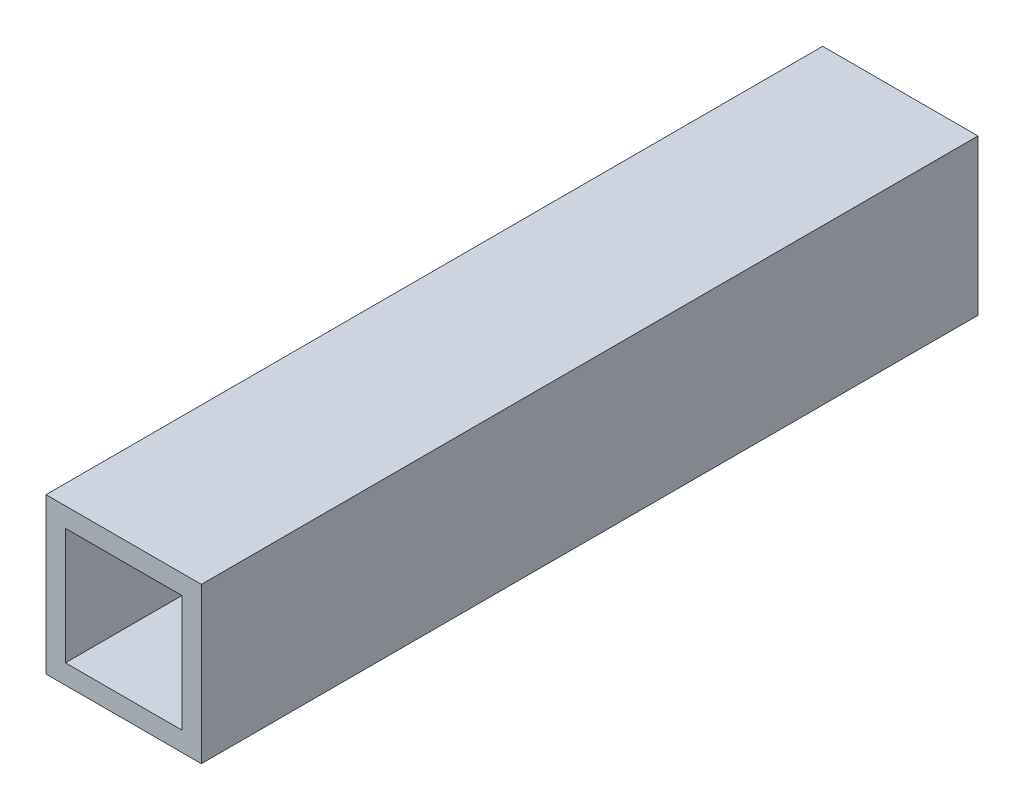
ISO-10303-21;
HEADER;
FILE_DESCRIPTION(('STEP AP214'),'2;1');
FILE_NAME('part.step','',(''),(''),'','','');
FILE_SCHEMA(('AUTOMOTIVE_DESIGN { 1 0 10303 214 1 1 1 1 }'));
ENDSEC;
DATA;
#1=APPLICATION_CONTEXT('core data for automotive mechanical design processes');
#2=APPLICATION_PROTOCOL_DEFINITION('international standard','automotive_design',2000,#1);
#3=PRODUCT_CONTEXT('',#1,'mechanical');
#4=PRODUCT('Part','Part','',(#3));
#5=PRODUCT_RELATED_PRODUCT_CATEGORY('part','',(#4));
#6=PRODUCT_DEFINITION_FORMATION('','',#4);
#7=PRODUCT_DEFINITION_CONTEXT('part definition',#1,'design');
#8=PRODUCT_DEFINITION('design','',#6,#7);
#9=PRODUCT_DEFINITION_SHAPE('','',#8);
#10=(LENGTH_UNIT() NAMED_UNIT(*) SI_UNIT(.MILLI.,.METRE.));
#11=(NAMED_UNIT(*) PLANE_ANGLE_UNIT() SI_UNIT($,.RADIAN.));
#12=(NAMED_UNIT(*) SI_UNIT($,.STERADIAN.) SOLID_ANGLE_UNIT());
#13=UNCERTAINTY_MEASURE_WITH_UNIT(LENGTH_MEASURE(1.E-05),#10,'distance_accuracy_value','');
#14=(GEOMETRIC_REPRESENTATION_CONTEXT(3) GLOBAL_UNCERTAINTY_ASSIGNED_CONTEXT((#13)) GLOBAL_UNIT_ASSIGNED_CONTEXT((#10,
#11,#12)) REPRESENTATION_CONTEXT('',''));
#15=CARTESIAN_POINT('',(0.,0.,0.));
#16=DIRECTION('',(0.,0.,1.));
#17=DIRECTION('',(1.,0.,0.));
#18=AXIS2_PLACEMENT_3D('',#15,#16,#17);
#19=CARTESIAN_POINT('',(0.,0.,127.));
#20=DIRECTION('',(0.,0.,1.));
#21=DIRECTION('',(1.,0.,0.));
#22=AXIS2_PLACEMENT_3D('',#19,#20,#21);
#23=PLANE('',#22);
#24=DIRECTION('',(0.,-1.,0.));
#25=VECTOR('',#24,1.);
#26=CARTESIAN_POINT('',(-12.7,-12.7,127.));
#27=LINE('',#26,#25);
#28=CARTESIAN_POINT('',(-12.7,12.7,127.));
#29=VERTEX_POINT('',#28);
#30=CARTESIAN_POINT('',(-12.7,-12.7,127.));
#31=VERTEX_POINT('',#30);
#32=EDGE_CURVE('E150',#29,#31,#27,.T.);
#33=ORIENTED_EDGE('',*,*,#32,.T.);
#34=DIRECTION('',(1.,0.,0.));
#35=VECTOR('',#34,1.);
#36=CARTESIAN_POINT('',(12.7,-12.7,127.));
#37=LINE('',#36,#35);
#38=CARTESIAN_POINT('',(12.7,-12.7,127.));
#39=VERTEX_POINT('',#38);
#40=EDGE_CURVE('E153',#31,#39,#37,.T.);
#41=ORIENTED_EDGE('',*,*,#40,.T.);
#42=DIRECTION('',(0.,1.,0.));
#43=VECTOR('',#42,1.);
#44=CARTESIAN_POINT('',(12.7,-12.7,127.));
#45=LINE('',#44,#43);
#46=CARTESIAN_POINT('',(12.7,12.7,127.));
#47=VERTEX_POINT('',#46);
#48=EDGE_CURVE('E156',#39,#47,#45,.T.);
#49=ORIENTED_EDGE('',*,*,#48,.T.);
#50=DIRECTION('',(-1.,0.,0.));
#51=VECTOR('',#50,1.);
#52=CARTESIAN_POINT('',(12.7,12.7,127.));
#53=LINE('',#52,#51);
#54=EDGE_CURVE('E158',#47,#29,#53,.T.);
#55=ORIENTED_EDGE('',*,*,#54,.T.);
#56=EDGE_LOOP('',(#33,#41,#49,#55));
#57=FACE_BOUND('',#56,.T.);
#58=DIRECTION('',(0.,-1.,0.));
#59=VECTOR('',#58,1.);
#60=CARTESIAN_POINT('',(-9.525,9.525,127.));
#61=LINE('',#60,#59);
#62=CARTESIAN_POINT('',(-9.525,9.525,127.));
#63=VERTEX_POINT('',#62);
#64=CARTESIAN_POINT('',(-9.525,-9.525,127.));
#65=VERTEX_POINT('',#64);
#66=EDGE_CURVE('E108',#63,#65,#61,.T.);
#67=ORIENTED_EDGE('',*,*,#66,.F.);
#68=DIRECTION('',(-1.,0.,0.));
#69=VECTOR('',#68,1.);
#70=CARTESIAN_POINT('',(9.525,9.525,127.));
#71=LINE('',#70,#69);
#72=CARTESIAN_POINT('',(9.525,9.525,127.));
#73=VERTEX_POINT('',#72);
#74=EDGE_CURVE('E49',#73,#63,#71,.T.);
#75=ORIENTED_EDGE('',*,*,#74,.F.);
#76=DIRECTION('',(0.,1.,0.));
#77=VECTOR('',#76,1.);
#78=CARTESIAN_POINT('',(9.525,-9.525,127.));
#79=LINE('',#78,#77);
#80=CARTESIAN_POINT('',(9.525,-9.525,127.));
#81=VERTEX_POINT('',#80);
#82=EDGE_CURVE('E116',#81,#73,#79,.T.);
#83=ORIENTED_EDGE('',*,*,#82,.F.);
#84=DIRECTION('',(1.,0.,0.));
#85=VECTOR('',#84,1.);
#86=CARTESIAN_POINT('',(-9.525,-9.525,127.));
#87=LINE('',#86,#85);
#88=EDGE_CURVE('E101',#65,#81,#87,.T.);
#89=ORIENTED_EDGE('',*,*,#88,.F.);
#90=EDGE_LOOP('',(#67,#75,#83,#89));
#91=FACE_BOUND('',#90,.T.);
#92=ADVANCED_FACE('F34',(#57,#91),#23,.T.);
#93=CARTESIAN_POINT('',(0.,0.,0.));
#94=DIRECTION('',(0.,0.,1.));
#95=DIRECTION('',(1.,0.,0.));
#96=AXIS2_PLACEMENT_3D('',#93,#94,#95);
#97=PLANE('',#96);
#98=DIRECTION('',(0.,-1.,0.));
#99=VECTOR('',#98,1.);
#100=CARTESIAN_POINT('',(-12.7,-12.7,0.));
#101=LINE('',#100,#99);
#102=CARTESIAN_POINT('',(-12.7,12.7,0.));
#103=VERTEX_POINT('',#102);
#104=CARTESIAN_POINT('',(-12.7,-12.7,0.));
#105=VERTEX_POINT('',#104);
#106=EDGE_CURVE('E112',#103,#105,#101,.T.);
#107=ORIENTED_EDGE('',*,*,#106,.F.);
#108=DIRECTION('',(-1.,0.,0.));
#109=VECTOR('',#108,1.);
#110=CARTESIAN_POINT('',(12.7,12.7,0.));
#111=LINE('',#110,#109);
#112=CARTESIAN_POINT('',(12.7,12.7,0.));
#113=VERTEX_POINT('',#112);
#114=EDGE_CURVE('E154',#113,#103,#111,.T.);
#115=ORIENTED_EDGE('',*,*,#114,.F.);
#116=DIRECTION('',(0.,1.,0.));
#117=VECTOR('',#116,1.);
#118=CARTESIAN_POINT('',(12.7,-12.7,0.));
#119=LINE('',#118,#117);
#120=CARTESIAN_POINT('',(12.7,-12.7,0.));
#121=VERTEX_POINT('',#120);
#122=EDGE_CURVE('E165',#121,#113,#119,.T.);
#123=ORIENTED_EDGE('',*,*,#122,.F.);
#124=DIRECTION('',(1.,0.,0.));
#125=VECTOR('',#124,1.);
#126=CARTESIAN_POINT('',(12.7,-12.7,0.));
#127=LINE('',#126,#125);
#128=EDGE_CURVE('E163',#105,#121,#127,.T.);
#129=ORIENTED_EDGE('',*,*,#128,.F.);
#130=EDGE_LOOP('',(#107,#115,#123,#129));
#131=FACE_BOUND('',#130,.T.);
#132=DIRECTION('',(-1.,0.,0.));
#133=VECTOR('',#132,1.);
#134=CARTESIAN_POINT('',(9.525,9.525,0.));
#135=LINE('',#134,#133);
#136=CARTESIAN_POINT('',(9.525,9.525,0.));
#137=VERTEX_POINT('',#136);
#138=CARTESIAN_POINT('',(-9.525,9.525,0.));
#139=VERTEX_POINT('',#138);
#140=EDGE_CURVE('E124',#137,#139,#135,.T.);
#141=ORIENTED_EDGE('',*,*,#140,.T.);
#142=DIRECTION('',(0.,-1.,0.));
#143=VECTOR('',#142,1.);
#144=CARTESIAN_POINT('',(-9.525,9.525,0.));
#145=LINE('',#144,#143);
#146=CARTESIAN_POINT('',(-9.525,-9.525,0.));
#147=VERTEX_POINT('',#146);
#148=EDGE_CURVE('E113',#139,#147,#145,.T.);
#149=ORIENTED_EDGE('',*,*,#148,.T.);
#150=DIRECTION('',(1.,0.,0.));
#151=VECTOR('',#150,1.);
#152=CARTESIAN_POINT('',(-9.525,-9.525,0.));
#153=LINE('',#152,#151);
#154=CARTESIAN_POINT('',(9.525,-9.525,0.));
#155=VERTEX_POINT('',#154);
#156=EDGE_CURVE('E57',#147,#155,#153,.T.);
#157=ORIENTED_EDGE('',*,*,#156,.T.);
#158=DIRECTION('',(0.,1.,0.));
#159=VECTOR('',#158,1.);
#160=CARTESIAN_POINT('',(9.525,-9.525,0.));
#161=LINE('',#160,#159);
#162=EDGE_CURVE('E137',#155,#137,#161,.T.);
#163=ORIENTED_EDGE('',*,*,#162,.T.);
#164=EDGE_LOOP('',(#141,#149,#157,#163));
#165=FACE_BOUND('',#164,.T.);
#166=ADVANCED_FACE('F183',(#131,#165),#97,.F.);
#167=CARTESIAN_POINT('',(-12.7,-12.7,127.));
#168=DIRECTION('',(1.,0.,0.));
#169=DIRECTION('',(0.,0.,-1.));
#170=AXIS2_PLACEMENT_3D('',#167,#168,#169);
#171=PLANE('',#170);
#172=ORIENTED_EDGE('',*,*,#106,.T.);
#173=DIRECTION('',(0.,0.,-1.));
#174=VECTOR('',#173,1.);
#175=CARTESIAN_POINT('',(-12.7,-12.7,127.));
#176=LINE('',#175,#174);
#177=EDGE_CURVE('E12',#31,#105,#176,.T.);
#178=ORIENTED_EDGE('',*,*,#177,.F.);
#179=ORIENTED_EDGE('',*,*,#32,.F.);
#180=DIRECTION('',(0.,0.,-1.));
#181=VECTOR('',#180,1.);
#182=CARTESIAN_POINT('',(-12.7,12.7,127.));
#183=LINE('',#182,#181);
#184=EDGE_CURVE('E160',#29,#103,#183,.T.);
#185=ORIENTED_EDGE('',*,*,#184,.T.);
#186=EDGE_LOOP('',(#172,#178,#179,#185));
#187=FACE_BOUND('',#186,.T.);
#188=ADVANCED_FACE('F36',(#187),#171,.F.);
#189=CARTESIAN_POINT('',(12.7,-12.7,127.));
#190=DIRECTION('',(0.,1.,0.));
#191=DIRECTION('',(-1.,0.,0.));
#192=AXIS2_PLACEMENT_3D('',#189,#190,#191);
#193=PLANE('',#192);
#194=ORIENTED_EDGE('',*,*,#128,.T.);
#195=DIRECTION('',(0.,0.,-1.));
#196=VECTOR('',#195,1.);
#197=CARTESIAN_POINT('',(12.7,-12.7,127.));
#198=LINE('',#197,#196);
#199=EDGE_CURVE('E42',#39,#121,#198,.T.);
#200=ORIENTED_EDGE('',*,*,#199,.F.);
#201=ORIENTED_EDGE('',*,*,#40,.F.);
#202=ORIENTED_EDGE('',*,*,#177,.T.);
#203=EDGE_LOOP('',(#194,#200,#201,#202));
#204=FACE_BOUND('',#203,.T.);
#205=ADVANCED_FACE('F193',(#204),#193,.F.);
#206=CARTESIAN_POINT('',(12.7,-12.7,127.));
#207=DIRECTION('',(-1.,0.,0.));
#208=DIRECTION('',(0.,0.,1.));
#209=AXIS2_PLACEMENT_3D('',#206,#207,#208);
#210=PLANE('',#209);
#211=ORIENTED_EDGE('',*,*,#122,.T.);
#212=DIRECTION('',(0.,0.,-1.));
#213=VECTOR('',#212,1.);
#214=CARTESIAN_POINT('',(12.7,12.7,127.));
#215=LINE('',#214,#213);
#216=EDGE_CURVE('E170',#47,#113,#215,.T.);
#217=ORIENTED_EDGE('',*,*,#216,.F.);
#218=ORIENTED_EDGE('',*,*,#48,.F.);
#219=ORIENTED_EDGE('',*,*,#199,.T.);
#220=EDGE_LOOP('',(#211,#217,#218,#219));
#221=FACE_BOUND('',#220,.T.);
#222=ADVANCED_FACE('F177',(#221),#210,.F.);
#223=CARTESIAN_POINT('',(12.7,12.7,127.));
#224=DIRECTION('',(0.,-1.,0.));
#225=DIRECTION('',(1.,0.,0.));
#226=AXIS2_PLACEMENT_3D('',#223,#224,#225);
#227=PLANE('',#226);
#228=ORIENTED_EDGE('',*,*,#114,.T.);
#229=ORIENTED_EDGE('',*,*,#184,.F.);
#230=ORIENTED_EDGE('',*,*,#54,.F.);
#231=ORIENTED_EDGE('',*,*,#216,.T.);
#232=EDGE_LOOP('',(#228,#229,#230,#231));
#233=FACE_BOUND('',#232,.T.);
#234=ADVANCED_FACE('F187',(#233),#227,.F.);
#235=CARTESIAN_POINT('',(9.525,9.525,127.));
#236=DIRECTION('',(0.,-1.,0.));
#237=DIRECTION('',(1.,0.,0.));
#238=AXIS2_PLACEMENT_3D('',#235,#236,#237);
#239=PLANE('',#238);
#240=ORIENTED_EDGE('',*,*,#140,.F.);
#241=DIRECTION('',(0.,0.,-1.));
#242=VECTOR('',#241,1.);
#243=CARTESIAN_POINT('',(9.525,9.525,127.));
#244=LINE('',#243,#242);
#245=EDGE_CURVE('E127',#73,#137,#244,.T.);
#246=ORIENTED_EDGE('',*,*,#245,.F.);
#247=ORIENTED_EDGE('',*,*,#74,.T.);
#248=DIRECTION('',(0.,0.,-1.));
#249=VECTOR('',#248,1.);
#250=CARTESIAN_POINT('',(-9.525,9.525,127.));
#251=LINE('',#250,#249);
#252=EDGE_CURVE('E110',#63,#139,#251,.T.);
#253=ORIENTED_EDGE('',*,*,#252,.T.);
#254=EDGE_LOOP('',(#240,#246,#247,#253));
#255=FACE_BOUND('',#254,.T.);
#256=ADVANCED_FACE('F210',(#255),#239,.T.);
#257=CARTESIAN_POINT('',(9.525,-9.525,127.));
#258=DIRECTION('',(-1.,0.,0.));
#259=DIRECTION('',(0.,0.,1.));
#260=AXIS2_PLACEMENT_3D('',#257,#258,#259);
#261=PLANE('',#260);
#262=ORIENTED_EDGE('',*,*,#162,.F.);
#263=DIRECTION('',(0.,0.,-1.));
#264=VECTOR('',#263,1.);
#265=CARTESIAN_POINT('',(9.525,-9.525,127.));
#266=LINE('',#265,#264);
#267=EDGE_CURVE('E135',#81,#155,#266,.T.);
#268=ORIENTED_EDGE('',*,*,#267,.F.);
#269=ORIENTED_EDGE('',*,*,#82,.T.);
#270=ORIENTED_EDGE('',*,*,#245,.T.);
#271=EDGE_LOOP('',(#262,#268,#269,#270));
#272=FACE_BOUND('',#271,.T.);
#273=ADVANCED_FACE('F214',(#272),#261,.T.);
#274=CARTESIAN_POINT('',(-9.525,-9.525,127.));
#275=DIRECTION('',(0.,1.,0.));
#276=DIRECTION('',(-1.,0.,0.));
#277=AXIS2_PLACEMENT_3D('',#274,#275,#276);
#278=PLANE('',#277);
#279=ORIENTED_EDGE('',*,*,#156,.F.);
#280=DIRECTION('',(0.,0.,-1.));
#281=VECTOR('',#280,1.);
#282=CARTESIAN_POINT('',(-9.525,-9.525,127.));
#283=LINE('',#282,#281);
#284=EDGE_CURVE('E97',#65,#147,#283,.T.);
#285=ORIENTED_EDGE('',*,*,#284,.F.);
#286=ORIENTED_EDGE('',*,*,#88,.T.);
#287=ORIENTED_EDGE('',*,*,#267,.T.);
#288=EDGE_LOOP('',(#279,#285,#286,#287));
#289=FACE_BOUND('',#288,.T.);
#290=ADVANCED_FACE('F99',(#289),#278,.T.);
#291=CARTESIAN_POINT('',(-9.525,9.525,127.));
#292=DIRECTION('',(1.,0.,0.));
#293=DIRECTION('',(0.,0.,-1.));
#294=AXIS2_PLACEMENT_3D('',#291,#292,#293);
#295=PLANE('',#294);
#296=ORIENTED_EDGE('',*,*,#148,.F.);
#297=ORIENTED_EDGE('',*,*,#252,.F.);
#298=ORIENTED_EDGE('',*,*,#66,.T.);
#299=ORIENTED_EDGE('',*,*,#284,.T.);
#300=EDGE_LOOP('',(#296,#297,#298,#299));
#301=FACE_BOUND('',#300,.T.);
#302=ADVANCED_FACE('F109',(#301),#295,.T.);
#303=CLOSED_SHELL('',(#92,#166,#188,#205,#222,#234,#256,#273,#290,#302));
#304=MANIFOLD_SOLID_BREP('B2',#303);
#305=ADVANCED_BREP_SHAPE_REPRESENTATION('',(#18,#304),#14);
#306=SHAPE_DEFINITION_REPRESENTATION(#9,#305);
ENDSEC;
END-ISO-10303-21;
